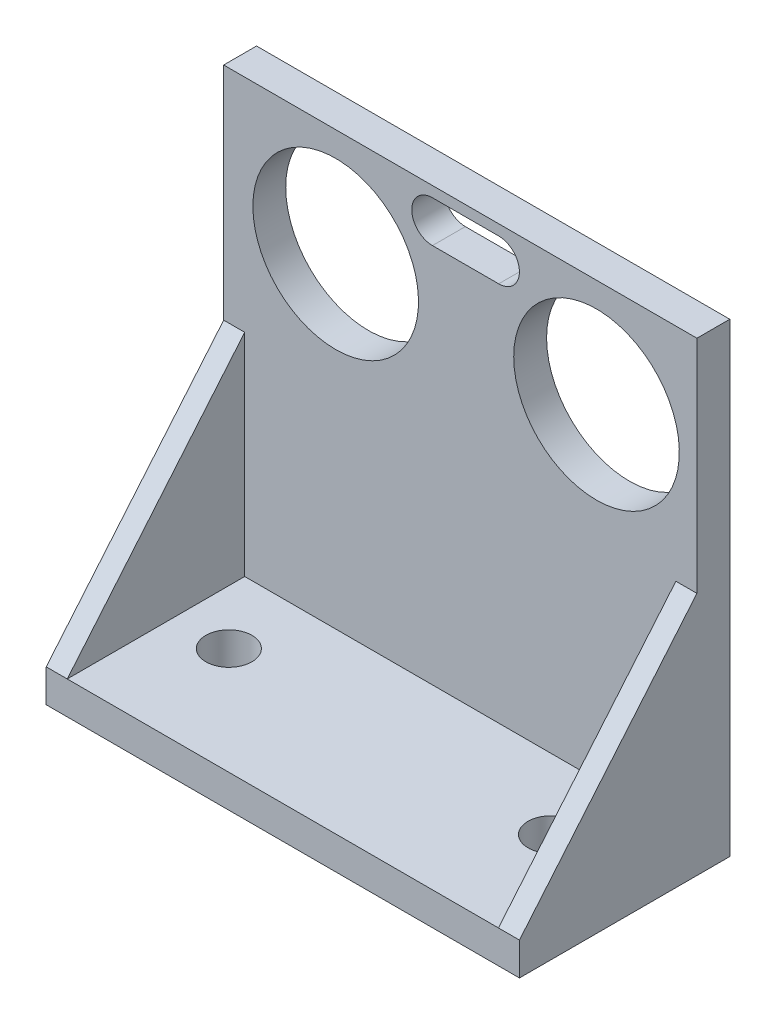
ISO-10303-21;
HEADER;
FILE_DESCRIPTION(('STEP AP214'),'2;1');
FILE_NAME('part.step','',(''),(''),'','','');
FILE_SCHEMA(('AUTOMOTIVE_DESIGN { 1 0 10303 214 1 1 1 1 }'));
ENDSEC;
DATA;
#1=APPLICATION_CONTEXT('core data for automotive mechanical design processes');
#2=APPLICATION_PROTOCOL_DEFINITION('international standard','automotive_design',2000,#1);
#3=PRODUCT_CONTEXT('',#1,'mechanical');
#4=PRODUCT('Part','Part','',(#3));
#5=PRODUCT_RELATED_PRODUCT_CATEGORY('part','',(#4));
#6=PRODUCT_DEFINITION_FORMATION('','',#4);
#7=PRODUCT_DEFINITION_CONTEXT('part definition',#1,'design');
#8=PRODUCT_DEFINITION('design','',#6,#7);
#9=PRODUCT_DEFINITION_SHAPE('','',#8);
#10=(LENGTH_UNIT() NAMED_UNIT(*) SI_UNIT(.MILLI.,.METRE.));
#11=(NAMED_UNIT(*) PLANE_ANGLE_UNIT() SI_UNIT($,.RADIAN.));
#12=(NAMED_UNIT(*) SI_UNIT($,.STERADIAN.) SOLID_ANGLE_UNIT());
#13=UNCERTAINTY_MEASURE_WITH_UNIT(LENGTH_MEASURE(1.E-05),#10,'distance_accuracy_value','');
#14=(GEOMETRIC_REPRESENTATION_CONTEXT(3) GLOBAL_UNCERTAINTY_ASSIGNED_CONTEXT((#13)) GLOBAL_UNIT_ASSIGNED_CONTEXT((#10,
#11,#12)) REPRESENTATION_CONTEXT('',''));
#15=CARTESIAN_POINT('',(0.,0.,0.));
#16=DIRECTION('',(0.,0.,1.));
#17=DIRECTION('',(1.,0.,0.));
#18=AXIS2_PLACEMENT_3D('',#15,#16,#17);
#19=CARTESIAN_POINT('',(0.,3.175,0.));
#20=DIRECTION('',(0.,-1.,0.));
#21=DIRECTION('',(0.,0.,-1.));
#22=AXIS2_PLACEMENT_3D('',#19,#20,#21);
#23=PLANE('',#22);
#24=CARTESIAN_POINT('',(15.5575,3.175,-0.190388698307699));
#25=DIRECTION('',(0.,-1.,0.));
#26=DIRECTION('',(0.,0.,-1.));
#27=AXIS2_PLACEMENT_3D('',#24,#25,#26);
#28=CIRCLE('',#27,2.2225);
#29=CARTESIAN_POINT('',(15.5575,3.175,-2.4128886983077));
#30=VERTEX_POINT('',#29);
#31=EDGE_CURVE('E257',#30,#30,#28,.T.);
#32=ORIENTED_EDGE('',*,*,#31,.T.);
#33=EDGE_LOOP('',(#32));
#34=FACE_BOUND('',#33,.T.);
#35=CARTESIAN_POINT('',(-15.5648854126354,3.175,-0.190388698307699));
#36=DIRECTION('',(0.,-1.,0.));
#37=DIRECTION('',(0.,0.,-1.));
#38=AXIS2_PLACEMENT_3D('',#35,#36,#37);
#39=CIRCLE('',#38,2.2225);
#40=CARTESIAN_POINT('',(-15.5648854126354,3.175,-2.4128886983077));
#41=VERTEX_POINT('',#40);
#42=EDGE_CURVE('E250',#41,#41,#39,.T.);
#43=ORIENTED_EDGE('',*,*,#42,.T.);
#44=EDGE_LOOP('',(#43));
#45=FACE_BOUND('',#44,.T.);
#46=DIRECTION('',(1.,0.,0.));
#47=VECTOR('',#46,1.);
#48=CARTESIAN_POINT('',(-22.86,3.175,10.16));
#49=LINE('',#48,#47);
#50=CARTESIAN_POINT('',(-20.828,3.175,10.16));
#51=VERTEX_POINT('',#50);
#52=CARTESIAN_POINT('',(20.828,3.175,10.16));
#53=VERTEX_POINT('',#52);
#54=EDGE_CURVE('E215',#51,#53,#49,.T.);
#55=ORIENTED_EDGE('',*,*,#54,.T.);
#56=DIRECTION('',(0.,0.,1.));
#57=VECTOR('',#56,1.);
#58=CARTESIAN_POINT('',(20.828,3.175,11.1446788387949));
#59=LINE('',#58,#57);
#60=CARTESIAN_POINT('',(20.828,3.175,-6.985));
#61=VERTEX_POINT('',#60);
#62=EDGE_CURVE('E172',#61,#53,#59,.T.);
#63=ORIENTED_EDGE('',*,*,#62,.F.);
#64=DIRECTION('',(1.,0.,0.));
#65=VECTOR('',#64,1.);
#66=CARTESIAN_POINT('',(-22.86,3.175,-6.985));
#67=LINE('',#66,#65);
#68=CARTESIAN_POINT('',(-20.828,3.175,-6.985));
#69=VERTEX_POINT('',#68);
#70=EDGE_CURVE('E203',#69,#61,#67,.T.);
#71=ORIENTED_EDGE('',*,*,#70,.F.);
#72=DIRECTION('',(0.,0.,-1.));
#73=VECTOR('',#72,1.);
#74=CARTESIAN_POINT('',(-20.828,3.175,11.144678838795));
#75=LINE('',#74,#73);
#76=EDGE_CURVE('E182',#51,#69,#75,.T.);
#77=ORIENTED_EDGE('',*,*,#76,.F.);
#78=EDGE_LOOP('',(#55,#63,#71,#77));
#79=FACE_BOUND('',#78,.T.);
#80=ADVANCED_FACE('F32',(#34,#45,#79),#23,.F.);
#81=CARTESIAN_POINT('',(22.86,3.175,10.16));
#82=DIRECTION('',(-1.,0.,0.));
#83=DIRECTION('',(0.,0.,1.));
#84=AXIS2_PLACEMENT_3D('',#81,#82,#83);
#85=PLANE('',#84);
#86=DIRECTION('',(0.,0.,-1.));
#87=VECTOR('',#86,1.);
#88=CARTESIAN_POINT('',(22.86,0.,10.16));
#89=LINE('',#88,#87);
#90=CARTESIAN_POINT('',(22.86,0.,10.16));
#91=VERTEX_POINT('',#90);
#92=CARTESIAN_POINT('',(22.86,0.,-10.16));
#93=VERTEX_POINT('',#92);
#94=EDGE_CURVE('E206',#91,#93,#89,.T.);
#95=ORIENTED_EDGE('',*,*,#94,.T.);
#96=DIRECTION('',(0.,-1.,0.));
#97=VECTOR('',#96,1.);
#98=CARTESIAN_POINT('',(22.86,3.175,-10.16));
#99=LINE('',#98,#97);
#100=CARTESIAN_POINT('',(22.86,44.958,-10.16));
#101=VERTEX_POINT('',#100);
#102=EDGE_CURVE('E232',#101,#93,#99,.T.);
#103=ORIENTED_EDGE('',*,*,#102,.F.);
#104=DIRECTION('',(0.,0.,1.));
#105=VECTOR('',#104,1.);
#106=CARTESIAN_POINT('',(22.86,44.958,-10.16));
#107=LINE('',#106,#105);
#108=CARTESIAN_POINT('',(22.86,44.958,-6.985));
#109=VERTEX_POINT('',#108);
#110=EDGE_CURVE('E191',#101,#109,#107,.T.);
#111=ORIENTED_EDGE('',*,*,#110,.T.);
#112=DIRECTION('',(0.,-1.,0.));
#113=VECTOR('',#112,1.);
#114=CARTESIAN_POINT('',(22.86,44.958,-6.985));
#115=LINE('',#114,#113);
#116=CARTESIAN_POINT('',(22.86,23.6076153450278,-6.985));
#117=VERTEX_POINT('',#116);
#118=EDGE_CURVE('E196',#109,#117,#115,.T.);
#119=ORIENTED_EDGE('',*,*,#118,.T.);
#120=DIRECTION('',(0.,0.766044443118979,-0.642787609686538));
#121=VECTOR('',#120,1.);
#122=CARTESIAN_POINT('',(22.86,2.00150545631465,11.1446788387949));
#123=LINE('',#122,#121);
#124=CARTESIAN_POINT('',(22.86,3.175,10.16));
#125=VERTEX_POINT('',#124);
#126=EDGE_CURVE('E171',#125,#117,#123,.T.);
#127=ORIENTED_EDGE('',*,*,#126,.F.);
#128=DIRECTION('',(0.,-1.,0.));
#129=VECTOR('',#128,1.);
#130=CARTESIAN_POINT('',(22.86,3.175,10.16));
#131=LINE('',#130,#129);
#132=EDGE_CURVE('E214',#125,#91,#131,.T.);
#133=ORIENTED_EDGE('',*,*,#132,.T.);
#134=EDGE_LOOP('',(#95,#103,#111,#119,#127,#133));
#135=FACE_BOUND('',#134,.T.);
#136=ADVANCED_FACE('F34',(#135),#85,.F.);
#137=CARTESIAN_POINT('',(-22.86,3.175,-10.16));
#138=DIRECTION('',(0.,0.,1.));
#139=DIRECTION('',(1.,0.,0.));
#140=AXIS2_PLACEMENT_3D('',#137,#138,#139);
#141=PLANE('',#140);
#142=DIRECTION('',(-1.,0.,0.));
#143=VECTOR('',#142,1.);
#144=CARTESIAN_POINT('',(3.71000000000001,39.933,-10.16));
#145=LINE('',#144,#143);
#146=CARTESIAN_POINT('',(3.71,39.933,-10.16));
#147=VERTEX_POINT('',#146);
#148=CARTESIAN_POINT('',(-2.68999999999999,39.933,-10.16));
#149=VERTEX_POINT('',#148);
#150=EDGE_CURVE('E138',#147,#149,#145,.T.);
#151=ORIENTED_EDGE('',*,*,#150,.F.);
#152=CARTESIAN_POINT('',(3.71000000000001,41.933,-10.16));
#153=DIRECTION('',(0.,0.,-1.));
#154=DIRECTION('',(-1.,0.,0.));
#155=AXIS2_PLACEMENT_3D('',#152,#153,#154);
#156=CIRCLE('',#155,2.);
#157=CARTESIAN_POINT('',(3.71000000000001,43.933,-10.16));
#158=VERTEX_POINT('',#157);
#159=EDGE_CURVE('E47',#158,#147,#156,.T.);
#160=ORIENTED_EDGE('',*,*,#159,.F.);
#161=DIRECTION('',(1.,0.,0.));
#162=VECTOR('',#161,1.);
#163=CARTESIAN_POINT('',(3.71000000000001,43.933,-10.16));
#164=LINE('',#163,#162);
#165=CARTESIAN_POINT('',(-2.68999999999999,43.933,-10.16));
#166=VERTEX_POINT('',#165);
#167=EDGE_CURVE('E145',#166,#158,#164,.T.);
#168=ORIENTED_EDGE('',*,*,#167,.F.);
#169=CARTESIAN_POINT('',(-2.68999999999999,41.933,-10.16));
#170=DIRECTION('',(0.,0.,-1.));
#171=DIRECTION('',(1.,0.,0.));
#172=AXIS2_PLACEMENT_3D('',#169,#170,#171);
#173=CIRCLE('',#172,2.);
#174=EDGE_CURVE('E129',#149,#166,#173,.T.);
#175=ORIENTED_EDGE('',*,*,#174,.F.);
#176=EDGE_LOOP('',(#151,#160,#168,#175));
#177=FACE_BOUND('',#176,.T.);
#178=CARTESIAN_POINT('',(-12.04,34.558,-10.16));
#179=DIRECTION('',(0.,0.,-1.));
#180=DIRECTION('',(-1.,0.,0.));
#181=AXIS2_PLACEMENT_3D('',#178,#179,#180);
#182=CIRCLE('',#181,8.);
#183=CARTESIAN_POINT('',(-20.04,34.558,-10.16));
#184=VERTEX_POINT('',#183);
#185=EDGE_CURVE('E152',#184,#184,#182,.T.);
#186=ORIENTED_EDGE('',*,*,#185,.F.);
#187=EDGE_LOOP('',(#186));
#188=FACE_BOUND('',#187,.T.);
#189=CARTESIAN_POINT('',(13.16,34.558,-10.16));
#190=DIRECTION('',(0.,0.,-1.));
#191=DIRECTION('',(-1.,0.,0.));
#192=AXIS2_PLACEMENT_3D('',#189,#190,#191);
#193=CIRCLE('',#192,8.);
#194=CARTESIAN_POINT('',(5.16,34.558,-10.16));
#195=VERTEX_POINT('',#194);
#196=EDGE_CURVE('E158',#195,#195,#193,.T.);
#197=ORIENTED_EDGE('',*,*,#196,.F.);
#198=EDGE_LOOP('',(#197));
#199=FACE_BOUND('',#198,.T.);
#200=DIRECTION('',(-1.,0.,0.));
#201=VECTOR('',#200,1.);
#202=CARTESIAN_POINT('',(-22.86,0.,-10.16));
#203=LINE('',#202,#201);
#204=CARTESIAN_POINT('',(-22.86,0.,-10.16));
#205=VERTEX_POINT('',#204);
#206=EDGE_CURVE('E218',#93,#205,#203,.T.);
#207=ORIENTED_EDGE('',*,*,#206,.T.);
#208=DIRECTION('',(0.,-1.,0.));
#209=VECTOR('',#208,1.);
#210=CARTESIAN_POINT('',(-22.86,3.175,-10.16));
#211=LINE('',#210,#209);
#212=CARTESIAN_POINT('',(-22.86,44.958,-10.16));
#213=VERTEX_POINT('',#212);
#214=EDGE_CURVE('E229',#213,#205,#211,.T.);
#215=ORIENTED_EDGE('',*,*,#214,.F.);
#216=DIRECTION('',(1.,0.,0.));
#217=VECTOR('',#216,1.);
#218=CARTESIAN_POINT('',(-22.86,44.958,-10.16));
#219=LINE('',#218,#217);
#220=EDGE_CURVE('E198',#213,#101,#219,.T.);
#221=ORIENTED_EDGE('',*,*,#220,.T.);
#222=ORIENTED_EDGE('',*,*,#102,.T.);
#223=EDGE_LOOP('',(#207,#215,#221,#222));
#224=FACE_BOUND('',#223,.T.);
#225=ADVANCED_FACE('F142',(#177,#188,#199,#224),#141,.F.);
#226=CARTESIAN_POINT('',(-22.86,3.175,10.16));
#227=DIRECTION('',(1.,0.,0.));
#228=DIRECTION('',(0.,0.,-1.));
#229=AXIS2_PLACEMENT_3D('',#226,#227,#228);
#230=PLANE('',#229);
#231=DIRECTION('',(0.,-1.,0.));
#232=VECTOR('',#231,1.);
#233=CARTESIAN_POINT('',(-22.86,3.175,10.16));
#234=LINE('',#233,#232);
#235=CARTESIAN_POINT('',(-22.86,3.175,10.16));
#236=VERTEX_POINT('',#235);
#237=CARTESIAN_POINT('',(-22.86,0.,10.16));
#238=VERTEX_POINT('',#237);
#239=EDGE_CURVE('E226',#236,#238,#234,.T.);
#240=ORIENTED_EDGE('',*,*,#239,.F.);
#241=DIRECTION('',(0.,0.766044443118979,-0.642787609686538));
#242=VECTOR('',#241,1.);
#243=CARTESIAN_POINT('',(-22.86,2.00150545631458,11.144678838795));
#244=LINE('',#243,#242);
#245=CARTESIAN_POINT('',(-22.86,23.6076153450278,-6.985));
#246=VERTEX_POINT('',#245);
#247=EDGE_CURVE('E185',#236,#246,#244,.T.);
#248=ORIENTED_EDGE('',*,*,#247,.T.);
#249=DIRECTION('',(0.,-1.,0.));
#250=VECTOR('',#249,1.);
#251=CARTESIAN_POINT('',(-22.86,44.958,-6.985));
#252=LINE('',#251,#250);
#253=CARTESIAN_POINT('',(-22.86,44.958,-6.985));
#254=VERTEX_POINT('',#253);
#255=EDGE_CURVE('E195',#254,#246,#252,.T.);
#256=ORIENTED_EDGE('',*,*,#255,.F.);
#257=DIRECTION('',(0.,0.,1.));
#258=VECTOR('',#257,1.);
#259=CARTESIAN_POINT('',(-22.86,44.958,-10.16));
#260=LINE('',#259,#258);
#261=EDGE_CURVE('E192',#213,#254,#260,.T.);
#262=ORIENTED_EDGE('',*,*,#261,.F.);
#263=ORIENTED_EDGE('',*,*,#214,.T.);
#264=DIRECTION('',(0.,0.,1.));
#265=VECTOR('',#264,1.);
#266=CARTESIAN_POINT('',(-22.86,0.,10.16));
#267=LINE('',#266,#265);
#268=EDGE_CURVE('E220',#205,#238,#267,.T.);
#269=ORIENTED_EDGE('',*,*,#268,.T.);
#270=EDGE_LOOP('',(#240,#248,#256,#262,#263,#269));
#271=FACE_BOUND('',#270,.T.);
#272=ADVANCED_FACE('F285',(#271),#230,.F.);
#273=CARTESIAN_POINT('',(-22.86,3.175,10.16));
#274=DIRECTION('',(0.,0.,-1.));
#275=DIRECTION('',(-1.,0.,0.));
#276=AXIS2_PLACEMENT_3D('',#273,#274,#275);
#277=PLANE('',#276);
#278=DIRECTION('',(1.,0.,0.));
#279=VECTOR('',#278,1.);
#280=CARTESIAN_POINT('',(-22.86,0.,10.16));
#281=LINE('',#280,#279);
#282=EDGE_CURVE('E222',#238,#91,#281,.T.);
#283=ORIENTED_EDGE('',*,*,#282,.T.);
#284=ORIENTED_EDGE('',*,*,#132,.F.);
#285=DIRECTION('',(1.,0.,0.));
#286=VECTOR('',#285,1.);
#287=CARTESIAN_POINT('',(22.86,3.175,10.16));
#288=LINE('',#287,#286);
#289=EDGE_CURVE('E168',#53,#125,#288,.T.);
#290=ORIENTED_EDGE('',*,*,#289,.F.);
#291=ORIENTED_EDGE('',*,*,#54,.F.);
#292=EDGE_CURVE('E211',#236,#51,#49,.T.);
#293=ORIENTED_EDGE('',*,*,#292,.F.);
#294=ORIENTED_EDGE('',*,*,#239,.T.);
#295=EDGE_LOOP('',(#283,#284,#290,#291,#293,#294));
#296=FACE_BOUND('',#295,.T.);
#297=ADVANCED_FACE('F270',(#296),#277,.F.);
#298=CARTESIAN_POINT('',(0.,0.,0.));
#299=DIRECTION('',(0.,-1.,0.));
#300=DIRECTION('',(0.,0.,-1.));
#301=AXIS2_PLACEMENT_3D('',#298,#299,#300);
#302=PLANE('',#301);
#303=CARTESIAN_POINT('',(15.5575,0.,-0.190388698307699));
#304=DIRECTION('',(0.,-1.,0.));
#305=DIRECTION('',(0.,0.,-1.));
#306=AXIS2_PLACEMENT_3D('',#303,#304,#305);
#307=CIRCLE('',#306,2.2225);
#308=CARTESIAN_POINT('',(15.5575,0.,-2.4128886983077));
#309=VERTEX_POINT('',#308);
#310=EDGE_CURVE('E260',#309,#309,#307,.T.);
#311=ORIENTED_EDGE('',*,*,#310,.F.);
#312=EDGE_LOOP('',(#311));
#313=FACE_BOUND('',#312,.T.);
#314=CARTESIAN_POINT('',(-15.5648854126354,0.,-0.190388698307699));
#315=DIRECTION('',(0.,-1.,0.));
#316=DIRECTION('',(0.,0.,-1.));
#317=AXIS2_PLACEMENT_3D('',#314,#315,#316);
#318=CIRCLE('',#317,2.2225);
#319=CARTESIAN_POINT('',(-15.5648854126354,0.,-2.4128886983077));
#320=VERTEX_POINT('',#319);
#321=EDGE_CURVE('E252',#320,#320,#318,.T.);
#322=ORIENTED_EDGE('',*,*,#321,.F.);
#323=EDGE_LOOP('',(#322));
#324=FACE_BOUND('',#323,.T.);
#325=ORIENTED_EDGE('',*,*,#94,.F.);
#326=ORIENTED_EDGE('',*,*,#282,.F.);
#327=ORIENTED_EDGE('',*,*,#268,.F.);
#328=ORIENTED_EDGE('',*,*,#206,.F.);
#329=EDGE_LOOP('',(#325,#326,#327,#328));
#330=FACE_BOUND('',#329,.T.);
#331=ADVANCED_FACE('F267',(#313,#324,#330),#302,.T.);
#332=CARTESIAN_POINT('',(-22.86,44.958,-6.985));
#333=DIRECTION('',(0.,0.,1.));
#334=DIRECTION('',(0.,-1.,0.));
#335=AXIS2_PLACEMENT_3D('',#332,#333,#334);
#336=PLANE('',#335);
#337=CARTESIAN_POINT('',(3.71000000000001,41.933,-6.985));
#338=DIRECTION('',(0.,0.,1.));
#339=DIRECTION('',(0.,-1.,0.));
#340=AXIS2_PLACEMENT_3D('',#337,#338,#339);
#341=CIRCLE('',#340,2.);
#342=CARTESIAN_POINT('',(3.71000000000001,39.933,-6.985));
#343=VERTEX_POINT('',#342);
#344=CARTESIAN_POINT('',(3.71000000000001,43.933,-6.985));
#345=VERTEX_POINT('',#344);
#346=EDGE_CURVE('E11',#343,#345,#341,.T.);
#347=ORIENTED_EDGE('',*,*,#346,.F.);
#348=DIRECTION('',(1.,0.,0.));
#349=VECTOR('',#348,1.);
#350=CARTESIAN_POINT('',(-22.86,39.933,-6.985));
#351=LINE('',#350,#349);
#352=CARTESIAN_POINT('',(-2.68999999999999,39.933,-6.985));
#353=VERTEX_POINT('',#352);
#354=EDGE_CURVE('E235',#353,#343,#351,.T.);
#355=ORIENTED_EDGE('',*,*,#354,.F.);
#356=CARTESIAN_POINT('',(-2.68999999999999,41.933,-6.985));
#357=DIRECTION('',(0.,0.,1.));
#358=DIRECTION('',(0.,-1.,0.));
#359=AXIS2_PLACEMENT_3D('',#356,#357,#358);
#360=CIRCLE('',#359,2.);
#361=CARTESIAN_POINT('',(-2.68999999999999,43.933,-6.985));
#362=VERTEX_POINT('',#361);
#363=EDGE_CURVE('E132',#362,#353,#360,.T.);
#364=ORIENTED_EDGE('',*,*,#363,.F.);
#365=DIRECTION('',(-1.,0.,0.));
#366=VECTOR('',#365,1.);
#367=CARTESIAN_POINT('',(-22.86,43.933,-6.985));
#368=LINE('',#367,#366);
#369=EDGE_CURVE('E40',#345,#362,#368,.T.);
#370=ORIENTED_EDGE('',*,*,#369,.F.);
#371=EDGE_LOOP('',(#347,#355,#364,#370));
#372=FACE_BOUND('',#371,.T.);
#373=CARTESIAN_POINT('',(-12.04,34.558,-6.985));
#374=DIRECTION('',(0.,0.,1.));
#375=DIRECTION('',(0.,-1.,0.));
#376=AXIS2_PLACEMENT_3D('',#373,#374,#375);
#377=CIRCLE('',#376,8.);
#378=CARTESIAN_POINT('',(-12.04,26.558,-6.985));
#379=VERTEX_POINT('',#378);
#380=EDGE_CURVE('E157',#379,#379,#377,.T.);
#381=ORIENTED_EDGE('',*,*,#380,.F.);
#382=EDGE_LOOP('',(#381));
#383=FACE_BOUND('',#382,.T.);
#384=CARTESIAN_POINT('',(13.16,34.558,-6.985));
#385=DIRECTION('',(0.,0.,1.));
#386=DIRECTION('',(0.,-1.,0.));
#387=AXIS2_PLACEMENT_3D('',#384,#385,#386);
#388=CIRCLE('',#387,8.);
#389=CARTESIAN_POINT('',(13.16,26.558,-6.985));
#390=VERTEX_POINT('',#389);
#391=EDGE_CURVE('E161',#390,#390,#388,.T.);
#392=ORIENTED_EDGE('',*,*,#391,.F.);
#393=EDGE_LOOP('',(#392));
#394=FACE_BOUND('',#393,.T.);
#395=DIRECTION('',(0.,1.,0.));
#396=VECTOR('',#395,1.);
#397=CARTESIAN_POINT('',(20.828,2.00150545631465,-6.985));
#398=LINE('',#397,#396);
#399=CARTESIAN_POINT('',(20.828,23.6076153450278,-6.98500000000001));
#400=VERTEX_POINT('',#399);
#401=EDGE_CURVE('E162',#61,#400,#398,.T.);
#402=ORIENTED_EDGE('',*,*,#401,.T.);
#403=DIRECTION('',(1.,0.,0.));
#404=VECTOR('',#403,1.);
#405=CARTESIAN_POINT('',(22.86,23.6076153450278,-6.985));
#406=LINE('',#405,#404);
#407=EDGE_CURVE('E164',#400,#117,#406,.T.);
#408=ORIENTED_EDGE('',*,*,#407,.T.);
#409=ORIENTED_EDGE('',*,*,#118,.F.);
#410=DIRECTION('',(1.,0.,0.));
#411=VECTOR('',#410,1.);
#412=CARTESIAN_POINT('',(-22.86,44.958,-6.985));
#413=LINE('',#412,#411);
#414=EDGE_CURVE('E207',#254,#109,#413,.T.);
#415=ORIENTED_EDGE('',*,*,#414,.F.);
#416=ORIENTED_EDGE('',*,*,#255,.T.);
#417=DIRECTION('',(1.,0.,0.));
#418=VECTOR('',#417,1.);
#419=CARTESIAN_POINT('',(-22.86,23.6076153450278,-6.985));
#420=LINE('',#419,#418);
#421=CARTESIAN_POINT('',(-20.828,23.6076153450278,-6.985));
#422=VERTEX_POINT('',#421);
#423=EDGE_CURVE('E179',#246,#422,#420,.T.);
#424=ORIENTED_EDGE('',*,*,#423,.T.);
#425=DIRECTION('',(0.,-1.,0.));
#426=VECTOR('',#425,1.);
#427=CARTESIAN_POINT('',(-20.828,2.00150545631458,-6.985));
#428=LINE('',#427,#426);
#429=EDGE_CURVE('E181',#422,#69,#428,.T.);
#430=ORIENTED_EDGE('',*,*,#429,.T.);
#431=ORIENTED_EDGE('',*,*,#70,.T.);
#432=EDGE_LOOP('',(#402,#408,#409,#415,#416,#424,#430,#431));
#433=FACE_BOUND('',#432,.T.);
#434=ADVANCED_FACE('F247',(#372,#383,#394,#433),#336,.T.);
#435=CARTESIAN_POINT('',(-22.86,44.958,-10.16));
#436=DIRECTION('',(0.,1.,0.));
#437=DIRECTION('',(0.,0.,1.));
#438=AXIS2_PLACEMENT_3D('',#435,#436,#437);
#439=PLANE('',#438);
#440=ORIENTED_EDGE('',*,*,#110,.F.);
#441=ORIENTED_EDGE('',*,*,#220,.F.);
#442=ORIENTED_EDGE('',*,*,#261,.T.);
#443=ORIENTED_EDGE('',*,*,#414,.T.);
#444=EDGE_LOOP('',(#440,#441,#442,#443));
#445=FACE_BOUND('',#444,.T.);
#446=ADVANCED_FACE('F292',(#445),#439,.T.);
#447=CARTESIAN_POINT('',(-20.828,2.00150545631458,11.144678838795));
#448=DIRECTION('',(1.,0.,0.));
#449=DIRECTION('',(0.,0.,-1.));
#450=AXIS2_PLACEMENT_3D('',#447,#448,#449);
#451=PLANE('',#450);
#452=ORIENTED_EDGE('',*,*,#429,.F.);
#453=DIRECTION('',(0.,0.766044443118979,-0.642787609686538));
#454=VECTOR('',#453,1.);
#455=CARTESIAN_POINT('',(-20.828,2.00150545631458,11.144678838795));
#456=LINE('',#455,#454);
#457=EDGE_CURVE('E167',#51,#422,#456,.T.);
#458=ORIENTED_EDGE('',*,*,#457,.F.);
#459=ORIENTED_EDGE('',*,*,#76,.T.);
#460=EDGE_LOOP('',(#452,#458,#459));
#461=FACE_BOUND('',#460,.T.);
#462=ADVANCED_FACE('F308',(#461),#451,.T.);
#463=CARTESIAN_POINT('',(-22.86,2.00150545631458,11.144678838795));
#464=DIRECTION('',(0.,0.642787609686538,0.766044443118979));
#465=DIRECTION('',(0.,-0.766044443118979,0.642787609686538));
#466=AXIS2_PLACEMENT_3D('',#463,#464,#465);
#467=PLANE('',#466);
#468=ORIENTED_EDGE('',*,*,#423,.F.);
#469=ORIENTED_EDGE('',*,*,#247,.F.);
#470=ORIENTED_EDGE('',*,*,#292,.T.);
#471=ORIENTED_EDGE('',*,*,#457,.T.);
#472=EDGE_LOOP('',(#468,#469,#470,#471));
#473=FACE_BOUND('',#472,.T.);
#474=ADVANCED_FACE('F310',(#473),#467,.T.);
#475=CARTESIAN_POINT('',(20.828,2.00150545631465,11.1446788387949));
#476=DIRECTION('',(-1.,0.,0.));
#477=DIRECTION('',(0.,0.,1.));
#478=AXIS2_PLACEMENT_3D('',#475,#476,#477);
#479=PLANE('',#478);
#480=ORIENTED_EDGE('',*,*,#401,.F.);
#481=ORIENTED_EDGE('',*,*,#62,.T.);
#482=DIRECTION('',(0.,0.766044443118979,-0.642787609686538));
#483=VECTOR('',#482,1.);
#484=CARTESIAN_POINT('',(20.828,2.00150545631465,11.1446788387949));
#485=LINE('',#484,#483);
#486=EDGE_CURVE('E165',#53,#400,#485,.T.);
#487=ORIENTED_EDGE('',*,*,#486,.T.);
#488=EDGE_LOOP('',(#480,#481,#487));
#489=FACE_BOUND('',#488,.T.);
#490=ADVANCED_FACE('F301',(#489),#479,.T.);
#491=CARTESIAN_POINT('',(22.86,2.00150545631465,11.1446788387949));
#492=DIRECTION('',(0.,0.642787609686538,0.766044443118979));
#493=DIRECTION('',(0.,-0.766044443118979,0.642787609686538));
#494=AXIS2_PLACEMENT_3D('',#491,#492,#493);
#495=PLANE('',#494);
#496=ORIENTED_EDGE('',*,*,#407,.F.);
#497=ORIENTED_EDGE('',*,*,#486,.F.);
#498=ORIENTED_EDGE('',*,*,#289,.T.);
#499=ORIENTED_EDGE('',*,*,#126,.T.);
#500=EDGE_LOOP('',(#496,#497,#498,#499));
#501=FACE_BOUND('',#500,.T.);
#502=ADVANCED_FACE('F299',(#501),#495,.T.);
#503=CARTESIAN_POINT('',(13.16,34.558,10.16));
#504=DIRECTION('',(0.,0.,-1.));
#505=DIRECTION('',(-1.,0.,0.));
#506=AXIS2_PLACEMENT_3D('',#503,#504,#505);
#507=CYLINDRICAL_SURFACE('',#506,8.);
#508=ORIENTED_EDGE('',*,*,#391,.T.);
#509=EDGE_LOOP('',(#508));
#510=FACE_BOUND('',#509,.T.);
#511=ORIENTED_EDGE('',*,*,#196,.T.);
#512=EDGE_LOOP('',(#511));
#513=FACE_BOUND('',#512,.T.);
#514=ADVANCED_FACE('F383',(#510,#513),#507,.F.);
#515=CARTESIAN_POINT('',(-12.04,34.558,10.16));
#516=DIRECTION('',(0.,0.,-1.));
#517=DIRECTION('',(-1.,0.,0.));
#518=AXIS2_PLACEMENT_3D('',#515,#516,#517);
#519=CYLINDRICAL_SURFACE('',#518,8.);
#520=ORIENTED_EDGE('',*,*,#380,.T.);
#521=EDGE_LOOP('',(#520));
#522=FACE_BOUND('',#521,.T.);
#523=ORIENTED_EDGE('',*,*,#185,.T.);
#524=EDGE_LOOP('',(#523));
#525=FACE_BOUND('',#524,.T.);
#526=ADVANCED_FACE('F392',(#522,#525),#519,.F.);
#527=CARTESIAN_POINT('',(3.71000000000001,41.933,10.16));
#528=DIRECTION('',(0.,0.,-1.));
#529=DIRECTION('',(-1.,0.,0.));
#530=AXIS2_PLACEMENT_3D('',#527,#528,#529);
#531=CYLINDRICAL_SURFACE('',#530,2.);
#532=ORIENTED_EDGE('',*,*,#346,.T.);
#533=DIRECTION('',(0.,0.,-1.));
#534=VECTOR('',#533,1.);
#535=CARTESIAN_POINT('',(3.71000000000001,43.933,10.16));
#536=LINE('',#535,#534);
#537=EDGE_CURVE('E150',#345,#158,#536,.T.);
#538=ORIENTED_EDGE('',*,*,#537,.T.);
#539=ORIENTED_EDGE('',*,*,#159,.T.);
#540=DIRECTION('',(0.,0.,-1.));
#541=VECTOR('',#540,1.);
#542=CARTESIAN_POINT('',(3.71000000000001,39.933,10.16));
#543=LINE('',#542,#541);
#544=EDGE_CURVE('E135',#343,#147,#543,.T.);
#545=ORIENTED_EDGE('',*,*,#544,.F.);
#546=EDGE_LOOP('',(#532,#538,#539,#545));
#547=FACE_BOUND('',#546,.T.);
#548=ADVANCED_FACE('F249',(#547),#531,.F.);
#549=CARTESIAN_POINT('',(3.71000000000001,43.933,10.16));
#550=DIRECTION('',(0.,1.,0.));
#551=DIRECTION('',(0.,0.,1.));
#552=AXIS2_PLACEMENT_3D('',#549,#550,#551);
#553=PLANE('',#552);
#554=ORIENTED_EDGE('',*,*,#369,.T.);
#555=DIRECTION('',(0.,0.,-1.));
#556=VECTOR('',#555,1.);
#557=CARTESIAN_POINT('',(-2.68999999999999,43.933,10.16));
#558=LINE('',#557,#556);
#559=EDGE_CURVE('E134',#362,#166,#558,.T.);
#560=ORIENTED_EDGE('',*,*,#559,.T.);
#561=ORIENTED_EDGE('',*,*,#167,.T.);
#562=ORIENTED_EDGE('',*,*,#537,.F.);
#563=EDGE_LOOP('',(#554,#560,#561,#562));
#564=FACE_BOUND('',#563,.T.);
#565=ADVANCED_FACE('F244',(#564),#553,.F.);
#566=CARTESIAN_POINT('',(-2.68999999999999,41.933,10.16));
#567=DIRECTION('',(0.,0.,-1.));
#568=DIRECTION('',(-1.,0.,0.));
#569=AXIS2_PLACEMENT_3D('',#566,#567,#568);
#570=CYLINDRICAL_SURFACE('',#569,2.);
#571=ORIENTED_EDGE('',*,*,#363,.T.);
#572=DIRECTION('',(0.,0.,-1.));
#573=VECTOR('',#572,1.);
#574=CARTESIAN_POINT('',(-2.68999999999999,39.933,10.16));
#575=LINE('',#574,#573);
#576=EDGE_CURVE('E55',#353,#149,#575,.T.);
#577=ORIENTED_EDGE('',*,*,#576,.T.);
#578=ORIENTED_EDGE('',*,*,#174,.T.);
#579=ORIENTED_EDGE('',*,*,#559,.F.);
#580=EDGE_LOOP('',(#571,#577,#578,#579));
#581=FACE_BOUND('',#580,.T.);
#582=ADVANCED_FACE('F126',(#581),#570,.F.);
#583=CARTESIAN_POINT('',(3.71000000000001,39.933,10.16));
#584=DIRECTION('',(0.,-1.,0.));
#585=DIRECTION('',(0.,0.,-1.));
#586=AXIS2_PLACEMENT_3D('',#583,#584,#585);
#587=PLANE('',#586);
#588=ORIENTED_EDGE('',*,*,#354,.T.);
#589=ORIENTED_EDGE('',*,*,#544,.T.);
#590=ORIENTED_EDGE('',*,*,#150,.T.);
#591=ORIENTED_EDGE('',*,*,#576,.F.);
#592=EDGE_LOOP('',(#588,#589,#590,#591));
#593=FACE_BOUND('',#592,.T.);
#594=ADVANCED_FACE('F139',(#593),#587,.F.);
#595=CARTESIAN_POINT('',(-15.5648854126354,44.958,-0.190388698307699));
#596=DIRECTION('',(0.,-1.,0.));
#597=DIRECTION('',(0.,0.,-1.));
#598=AXIS2_PLACEMENT_3D('',#595,#596,#597);
#599=CYLINDRICAL_SURFACE('',#598,2.2225);
#600=ORIENTED_EDGE('',*,*,#321,.T.);
#601=EDGE_LOOP('',(#600));
#602=FACE_BOUND('',#601,.T.);
#603=ORIENTED_EDGE('',*,*,#42,.F.);
#604=EDGE_LOOP('',(#603));
#605=FACE_BOUND('',#604,.T.);
#606=ADVANCED_FACE('F424',(#602,#605),#599,.F.);
#607=CARTESIAN_POINT('',(15.5575,44.958,-0.190388698307699));
#608=DIRECTION('',(0.,-1.,0.));
#609=DIRECTION('',(0.,0.,-1.));
#610=AXIS2_PLACEMENT_3D('',#607,#608,#609);
#611=CYLINDRICAL_SURFACE('',#610,2.2225);
#612=ORIENTED_EDGE('',*,*,#310,.T.);
#613=EDGE_LOOP('',(#612));
#614=FACE_BOUND('',#613,.T.);
#615=ORIENTED_EDGE('',*,*,#31,.F.);
#616=EDGE_LOOP('',(#615));
#617=FACE_BOUND('',#616,.T.);
#618=ADVANCED_FACE('F264',(#614,#617),#611,.F.);
#619=CLOSED_SHELL('',(#80,#136,#225,#272,#297,#331,#434,#446,#462,#474,#490,#502,#514,#526,#548,
#565,#582,#594,#606,#618));
#620=MANIFOLD_SOLID_BREP('B2',#619);
#621=ADVANCED_BREP_SHAPE_REPRESENTATION('',(#18,#620),#14);
#622=SHAPE_DEFINITION_REPRESENTATION(#9,#621);
ENDSEC;
END-ISO-10303-21;
